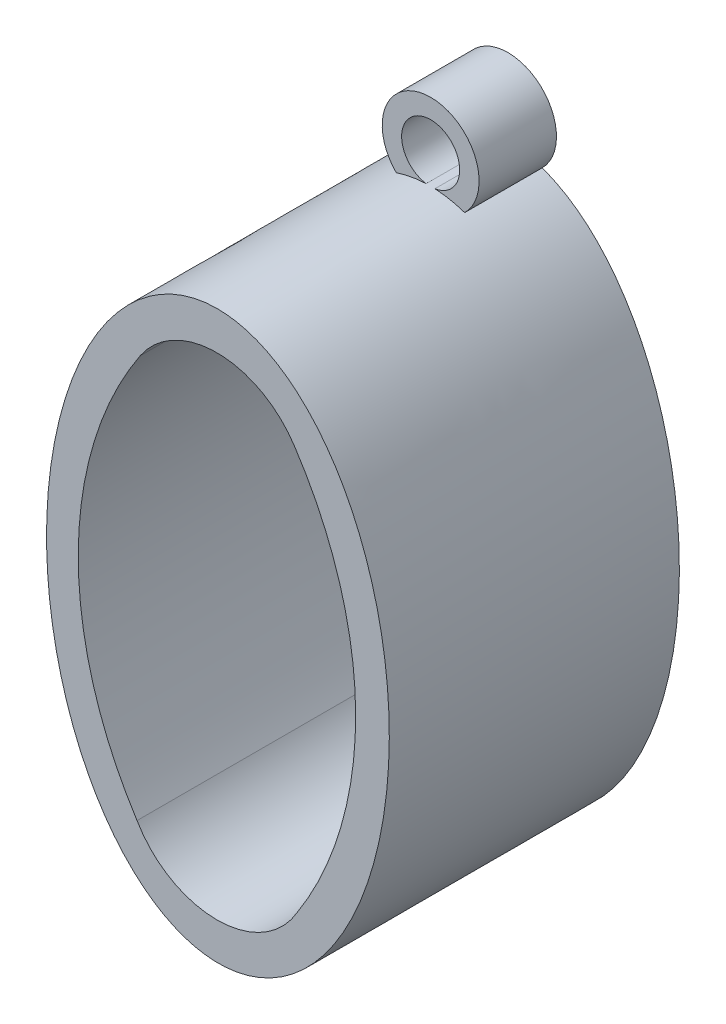
ISO-10303-21;
HEADER;
FILE_DESCRIPTION(('STEP AP214'),'2;1');
FILE_NAME('part.step','',(''),(''),'','','');
FILE_SCHEMA(('AUTOMOTIVE_DESIGN { 1 0 10303 214 1 1 1 1 }'));
ENDSEC;
DATA;
#1=APPLICATION_CONTEXT('core data for automotive mechanical design processes');
#2=APPLICATION_PROTOCOL_DEFINITION('international standard','automotive_design',2000,#1);
#3=PRODUCT_CONTEXT('',#1,'mechanical');
#4=PRODUCT('Part','Part','',(#3));
#5=PRODUCT_RELATED_PRODUCT_CATEGORY('part','',(#4));
#6=PRODUCT_DEFINITION_FORMATION('','',#4);
#7=PRODUCT_DEFINITION_CONTEXT('part definition',#1,'design');
#8=PRODUCT_DEFINITION('design','',#6,#7);
#9=PRODUCT_DEFINITION_SHAPE('','',#8);
#10=(LENGTH_UNIT() NAMED_UNIT(*) SI_UNIT(.MILLI.,.METRE.));
#11=(NAMED_UNIT(*) PLANE_ANGLE_UNIT() SI_UNIT($,.RADIAN.));
#12=(NAMED_UNIT(*) SI_UNIT($,.STERADIAN.) SOLID_ANGLE_UNIT());
#13=UNCERTAINTY_MEASURE_WITH_UNIT(LENGTH_MEASURE(1.E-05),#10,'distance_accuracy_value','');
#14=(GEOMETRIC_REPRESENTATION_CONTEXT(3) GLOBAL_UNCERTAINTY_ASSIGNED_CONTEXT((#13)) GLOBAL_UNIT_ASSIGNED_CONTEXT((#10,
#11,#12)) REPRESENTATION_CONTEXT('',''));
#15=CARTESIAN_POINT('',(0.,0.,0.));
#16=DIRECTION('',(0.,0.,1.));
#17=DIRECTION('',(1.,0.,0.));
#18=AXIS2_PLACEMENT_3D('',#15,#16,#17);
#19=CARTESIAN_POINT('',(0.,0.,15.));
#20=DIRECTION('',(0.,0.,1.));
#21=DIRECTION('',(1.,0.,0.));
#22=AXIS2_PLACEMENT_3D('',#19,#20,#21);
#23=PLANE('',#22);
#24=CARTESIAN_POINT('',(0.,0.,15.));
#25=DIRECTION('',(0.,0.,1.));
#26=DIRECTION('',(-0.00347416614958215,0.999993965066572,0.));
#27=AXIS2_PLACEMENT_3D('',#24,#25,#26);
#28=ELLIPSE('',#27,14.6452180036689,8.86218100127628);
#29=CARTESIAN_POINT('',(-0.0508799206415974,14.6451296207532,15.));
#30=VERTEX_POINT('',#29);
#31=EDGE_CURVE('E111',#30,#30,#28,.T.);
#32=ORIENTED_EDGE('',*,*,#31,.T.);
#33=EDGE_LOOP('',(#32));
#34=FACE_BOUND('',#33,.T.);
#35=CARTESIAN_POINT('',(-0.0499946264238908,-7.9621919744803,15.));
#36=DIRECTION('',(0.,0.,1.));
#37=DIRECTION('',(1.,0.,0.));
#38=AXIS2_PLACEMENT_3D('',#35,#36,#37);
#39=CIRCLE('',#38,4.7752);
#40=CARTESIAN_POINT('',(-4.18266193517475,-10.3545957771821,15.));
#41=VERTEX_POINT('',#40);
#42=CARTESIAN_POINT('',(4.08624409336584,-10.3484158308928,15.));
#43=VERTEX_POINT('',#42);
#44=EDGE_CURVE('E125',#41,#43,#39,.T.);
#45=ORIENTED_EDGE('',*,*,#44,.F.);
#46=CARTESIAN_POINT('',(11.8273820126439,-0.0307886892461032,15.));
#47=DIRECTION('',(0.,0.,1.));
#48=DIRECTION('',(1.,0.,0.));
#49=AXIS2_PLACEMENT_3D('',#46,#47,#48);
#50=CIRCLE('',#49,19.05);
#51=CARTESIAN_POINT('',(-4.02320958753552,10.5361998091068,15.));
#52=VERTEX_POINT('',#51);
#53=EDGE_CURVE('E123',#52,#41,#50,.T.);
#54=ORIENTED_EDGE('',*,*,#53,.F.);
#55=CARTESIAN_POINT('',(-0.0499946264238908,7.8874080255197,15.));
#56=DIRECTION('',(0.,0.,1.));
#57=DIRECTION('',(1.,0.,0.));
#58=AXIS2_PLACEMENT_3D('',#55,#56,#57);
#59=CIRCLE('',#58,4.7752);
#60=CARTESIAN_POINT('',(3.95954245501899,10.4808897456277,15.));
#61=VERTEX_POINT('',#60);
#62=EDGE_CURVE('E131',#61,#52,#59,.T.);
#63=ORIENTED_EDGE('',*,*,#62,.F.);
#64=CARTESIAN_POINT('',(-11.9277832004149,-0.0307886892461032,15.));
#65=DIRECTION('',(0.,0.,1.));
#66=DIRECTION('',(1.,0.,0.));
#67=AXIS2_PLACEMENT_3D('',#64,#65,#66);
#68=CIRCLE('',#67,19.05);
#69=EDGE_CURVE('E128',#43,#61,#68,.T.);
#70=ORIENTED_EDGE('',*,*,#69,.F.);
#71=EDGE_LOOP('',(#45,#54,#63,#70));
#72=FACE_BOUND('',#71,.T.);
#73=ADVANCED_FACE('F33',(#34,#72),#23,.T.);
#74=CARTESIAN_POINT('',(0.,0.,0.));
#75=DIRECTION('',(0.,0.,1.));
#76=DIRECTION('',(1.,0.,0.));
#77=AXIS2_PLACEMENT_3D('',#74,#75,#76);
#78=PLANE('',#77);
#79=CARTESIAN_POINT('',(0.,0.,0.));
#80=DIRECTION('',(0.,0.,1.));
#81=DIRECTION('',(-0.00347416614958215,0.999993965066572,0.));
#82=AXIS2_PLACEMENT_3D('',#79,#80,#81);
#83=ELLIPSE('',#82,14.6452180036689,8.86218100127628);
#84=CARTESIAN_POINT('',(-1.77711092169693,14.3582882787311,0.));
#85=VERTEX_POINT('',#84);
#86=CARTESIAN_POINT('',(1.76116803773183,14.3423786443097,0.));
#87=VERTEX_POINT('',#86);
#88=EDGE_CURVE('E156',#85,#87,#83,.T.);
#89=ORIENTED_EDGE('',*,*,#88,.F.);
#90=CARTESIAN_POINT('',(0.,16.1231702656899,0.));
#91=DIRECTION('',(0.,0.,-1.));
#92=DIRECTION('',(-1.,0.,0.));
#93=AXIS2_PLACEMENT_3D('',#90,#91,#92);
#94=CIRCLE('',#93,2.50458213199453);
#95=EDGE_CURVE('E114',#85,#87,#94,.T.);
#96=ORIENTED_EDGE('',*,*,#95,.T.);
#97=EDGE_LOOP('',(#89,#96));
#98=FACE_BOUND('',#97,.T.);
#99=CARTESIAN_POINT('',(11.8273820126439,-0.0307886892461032,0.));
#100=DIRECTION('',(0.,0.,1.));
#101=DIRECTION('',(1.,0.,0.));
#102=AXIS2_PLACEMENT_3D('',#99,#100,#101);
#103=CIRCLE('',#102,19.05);
#104=CARTESIAN_POINT('',(-4.02320958753552,10.5361998091068,0.));
#105=VERTEX_POINT('',#104);
#106=CARTESIAN_POINT('',(-4.18266193517475,-10.3545957771821,0.));
#107=VERTEX_POINT('',#106);
#108=EDGE_CURVE('E121',#105,#107,#103,.T.);
#109=ORIENTED_EDGE('',*,*,#108,.T.);
#110=CARTESIAN_POINT('',(-0.0499946264238908,-7.9621919744803,0.));
#111=DIRECTION('',(0.,0.,1.));
#112=DIRECTION('',(1.,0.,0.));
#113=AXIS2_PLACEMENT_3D('',#110,#111,#112);
#114=CIRCLE('',#113,4.7752);
#115=CARTESIAN_POINT('',(4.08624409336584,-10.3484158308928,0.));
#116=VERTEX_POINT('',#115);
#117=EDGE_CURVE('E136',#107,#116,#114,.T.);
#118=ORIENTED_EDGE('',*,*,#117,.T.);
#119=CARTESIAN_POINT('',(-11.9277832004149,-0.0307886892461032,0.));
#120=DIRECTION('',(0.,0.,1.));
#121=DIRECTION('',(1.,0.,0.));
#122=AXIS2_PLACEMENT_3D('',#119,#120,#121);
#123=CIRCLE('',#122,19.05);
#124=CARTESIAN_POINT('',(3.95954245501899,10.4808897456277,0.));
#125=VERTEX_POINT('',#124);
#126=EDGE_CURVE('E139',#116,#125,#123,.T.);
#127=ORIENTED_EDGE('',*,*,#126,.T.);
#128=CARTESIAN_POINT('',(-0.0499946264238908,7.8874080255197,0.));
#129=DIRECTION('',(0.,0.,1.));
#130=DIRECTION('',(1.,0.,0.));
#131=AXIS2_PLACEMENT_3D('',#128,#129,#130);
#132=CIRCLE('',#131,4.7752);
#133=EDGE_CURVE('E126',#125,#105,#132,.T.);
#134=ORIENTED_EDGE('',*,*,#133,.T.);
#135=EDGE_LOOP('',(#109,#118,#127,#134));
#136=FACE_BOUND('',#135,.T.);
#137=CARTESIAN_POINT('',(0.219166915189247,14.6392680238672,0.));
#138=VERTEX_POINT('',#137);
#139=CARTESIAN_POINT('',(-0.233136717895372,14.6413985994846,0.));
#140=VERTEX_POINT('',#139);
#141=EDGE_CURVE('E152',#138,#140,#83,.T.);
#142=ORIENTED_EDGE('',*,*,#141,.F.);
#143=CARTESIAN_POINT('',(0.,16.1231702656899,0.));
#144=DIRECTION('',(0.,0.,-1.));
#145=DIRECTION('',(-1.,0.,0.));
#146=AXIS2_PLACEMENT_3D('',#143,#144,#145);
#147=CIRCLE('',#146,1.5);
#148=EDGE_CURVE('E110',#140,#138,#147,.T.);
#149=ORIENTED_EDGE('',*,*,#148,.F.);
#150=EDGE_LOOP('',(#142,#149));
#151=FACE_BOUND('',#150,.T.);
#152=ADVANCED_FACE('F159',(#98,#136,#151),#78,.F.);
#153=DIRECTION('',(0.,0.,-1.));
#154=VECTOR('',#153,1.);
#155=SURFACE_OF_LINEAR_EXTRUSION('',#28,#154);
#156=ORIENTED_EDGE('',*,*,#31,.F.);
#157=EDGE_LOOP('',(#156));
#158=FACE_BOUND('',#157,.T.);
#159=CARTESIAN_POINT('',(0.,0.,4.));
#160=DIRECTION('',(0.,0.,1.));
#161=DIRECTION('',(-0.00347416614958215,0.999993965066572,0.));
#162=AXIS2_PLACEMENT_3D('',#159,#160,#161);
#163=ELLIPSE('',#162,14.6452180036689,8.86218100127628);
#164=CARTESIAN_POINT('',(-1.77711092169692,14.3582882787311,4.));
#165=VERTEX_POINT('',#164);
#166=CARTESIAN_POINT('',(-0.233136717895372,14.6413985994846,4.));
#167=VERTEX_POINT('',#166);
#168=EDGE_CURVE('E42',#165,#167,#163,.F.);
#169=ORIENTED_EDGE('',*,*,#168,.F.);
#170=DIRECTION('',(0.,0.,-1.));
#171=VECTOR('',#170,1.);
#172=CARTESIAN_POINT('',(-1.77711092169693,14.3582882787311,15.));
#173=LINE('',#172,#171);
#174=EDGE_CURVE('E11',#165,#85,#173,.T.);
#175=ORIENTED_EDGE('',*,*,#174,.T.);
#176=ORIENTED_EDGE('',*,*,#88,.T.);
#177=DIRECTION('',(0.,0.,-1.));
#178=VECTOR('',#177,1.);
#179=CARTESIAN_POINT('',(1.76116803773183,14.3423786443097,15.));
#180=LINE('',#179,#178);
#181=CARTESIAN_POINT('',(1.76116803773182,14.3423786443097,4.));
#182=VERTEX_POINT('',#181);
#183=EDGE_CURVE('E98',#87,#182,#180,.F.);
#184=ORIENTED_EDGE('',*,*,#183,.T.);
#185=CARTESIAN_POINT('',(0.219166915189248,14.6392680238672,4.));
#186=VERTEX_POINT('',#185);
#187=EDGE_CURVE('E93',#186,#182,#163,.F.);
#188=ORIENTED_EDGE('',*,*,#187,.F.);
#189=DIRECTION('',(0.,0.,-1.));
#190=VECTOR('',#189,1.);
#191=CARTESIAN_POINT('',(0.219166915189247,14.6392680238672,15.));
#192=LINE('',#191,#190);
#193=EDGE_CURVE('E95',#138,#186,#192,.F.);
#194=ORIENTED_EDGE('',*,*,#193,.F.);
#195=ORIENTED_EDGE('',*,*,#141,.T.);
#196=DIRECTION('',(0.,0.,-1.));
#197=VECTOR('',#196,1.);
#198=CARTESIAN_POINT('',(-0.233136717895372,14.6413985994846,15.));
#199=LINE('',#198,#197);
#200=EDGE_CURVE('E52',#167,#140,#199,.T.);
#201=ORIENTED_EDGE('',*,*,#200,.F.);
#202=EDGE_LOOP('',(#169,#175,#176,#184,#188,#194,#195,#201));
#203=FACE_BOUND('',#202,.T.);
#204=ADVANCED_FACE('F35',(#158,#203),#155,.F.);
#205=CARTESIAN_POINT('',(11.8273820126439,-0.0307886892461032,15.));
#206=DIRECTION('',(0.,0.,-1.));
#207=DIRECTION('',(-1.,0.,0.));
#208=AXIS2_PLACEMENT_3D('',#205,#206,#207);
#209=CYLINDRICAL_SURFACE('',#208,19.05);
#210=ORIENTED_EDGE('',*,*,#108,.F.);
#211=DIRECTION('',(0.,0.,-1.));
#212=VECTOR('',#211,1.);
#213=CARTESIAN_POINT('',(-4.02320958753552,10.5361998091068,15.));
#214=LINE('',#213,#212);
#215=EDGE_CURVE('E133',#52,#105,#214,.T.);
#216=ORIENTED_EDGE('',*,*,#215,.F.);
#217=ORIENTED_EDGE('',*,*,#53,.T.);
#218=DIRECTION('',(0.,0.,-1.));
#219=VECTOR('',#218,1.);
#220=CARTESIAN_POINT('',(-4.18266193517475,-10.3545957771821,15.));
#221=LINE('',#220,#219);
#222=EDGE_CURVE('E150',#41,#107,#221,.T.);
#223=ORIENTED_EDGE('',*,*,#222,.T.);
#224=EDGE_LOOP('',(#210,#216,#217,#223));
#225=FACE_BOUND('',#224,.T.);
#226=ADVANCED_FACE('F166',(#225),#209,.F.);
#227=CARTESIAN_POINT('',(-0.0499946264238908,-7.9621919744803,15.));
#228=DIRECTION('',(0.,0.,-1.));
#229=DIRECTION('',(-1.,0.,0.));
#230=AXIS2_PLACEMENT_3D('',#227,#228,#229);
#231=CYLINDRICAL_SURFACE('',#230,4.7752);
#232=ORIENTED_EDGE('',*,*,#117,.F.);
#233=ORIENTED_EDGE('',*,*,#222,.F.);
#234=ORIENTED_EDGE('',*,*,#44,.T.);
#235=DIRECTION('',(0.,0.,-1.));
#236=VECTOR('',#235,1.);
#237=CARTESIAN_POINT('',(4.08624409336584,-10.3484158308928,15.));
#238=LINE('',#237,#236);
#239=EDGE_CURVE('E148',#43,#116,#238,.T.);
#240=ORIENTED_EDGE('',*,*,#239,.T.);
#241=EDGE_LOOP('',(#232,#233,#234,#240));
#242=FACE_BOUND('',#241,.T.);
#243=ADVANCED_FACE('F175',(#242),#231,.F.);
#244=CARTESIAN_POINT('',(-11.9277832004149,-0.0307886892461032,15.));
#245=DIRECTION('',(0.,0.,-1.));
#246=DIRECTION('',(-1.,0.,0.));
#247=AXIS2_PLACEMENT_3D('',#244,#245,#246);
#248=CYLINDRICAL_SURFACE('',#247,19.05);
#249=ORIENTED_EDGE('',*,*,#126,.F.);
#250=ORIENTED_EDGE('',*,*,#239,.F.);
#251=ORIENTED_EDGE('',*,*,#69,.T.);
#252=DIRECTION('',(0.,0.,-1.));
#253=VECTOR('',#252,1.);
#254=CARTESIAN_POINT('',(3.95954245501899,10.4808897456277,15.));
#255=LINE('',#254,#253);
#256=EDGE_CURVE('E146',#61,#125,#255,.T.);
#257=ORIENTED_EDGE('',*,*,#256,.T.);
#258=EDGE_LOOP('',(#249,#250,#251,#257));
#259=FACE_BOUND('',#258,.T.);
#260=ADVANCED_FACE('F179',(#259),#248,.F.);
#261=CARTESIAN_POINT('',(-0.0499946264238908,7.8874080255197,15.));
#262=DIRECTION('',(0.,0.,-1.));
#263=DIRECTION('',(-1.,0.,0.));
#264=AXIS2_PLACEMENT_3D('',#261,#262,#263);
#265=CYLINDRICAL_SURFACE('',#264,4.7752);
#266=ORIENTED_EDGE('',*,*,#133,.F.);
#267=ORIENTED_EDGE('',*,*,#256,.F.);
#268=ORIENTED_EDGE('',*,*,#62,.T.);
#269=ORIENTED_EDGE('',*,*,#215,.T.);
#270=EDGE_LOOP('',(#266,#267,#268,#269));
#271=FACE_BOUND('',#270,.T.);
#272=ADVANCED_FACE('F183',(#271),#265,.F.);
#273=CARTESIAN_POINT('',(0.,16.1231702656899,4.));
#274=DIRECTION('',(0.,0.,-1.));
#275=DIRECTION('',(-1.,0.,0.));
#276=AXIS2_PLACEMENT_3D('',#273,#274,#275);
#277=CYLINDRICAL_SURFACE('',#276,2.50458213199453);
#278=ORIENTED_EDGE('',*,*,#174,.F.);
#279=CARTESIAN_POINT('',(0.,16.1231702656899,4.));
#280=DIRECTION('',(0.,0.,-1.));
#281=DIRECTION('',(-1.,0.,0.));
#282=AXIS2_PLACEMENT_3D('',#279,#280,#281);
#283=CIRCLE('',#282,2.50458213199453);
#284=EDGE_CURVE('E117',#165,#182,#283,.T.);
#285=ORIENTED_EDGE('',*,*,#284,.T.);
#286=ORIENTED_EDGE('',*,*,#183,.F.);
#287=ORIENTED_EDGE('',*,*,#95,.F.);
#288=EDGE_LOOP('',(#278,#285,#286,#287));
#289=FACE_BOUND('',#288,.T.);
#290=ADVANCED_FACE('F187',(#289),#277,.T.);
#291=CARTESIAN_POINT('',(0.,16.1231702656899,4.));
#292=DIRECTION('',(0.,0.,-1.));
#293=DIRECTION('',(-1.,0.,0.));
#294=AXIS2_PLACEMENT_3D('',#291,#292,#293);
#295=PLANE('',#294);
#296=CARTESIAN_POINT('',(0.,16.1231702656899,4.));
#297=DIRECTION('',(0.,0.,-1.));
#298=DIRECTION('',(-1.,0.,0.));
#299=AXIS2_PLACEMENT_3D('',#296,#297,#298);
#300=CIRCLE('',#299,1.5);
#301=EDGE_CURVE('E108',#167,#186,#300,.T.);
#302=ORIENTED_EDGE('',*,*,#301,.T.);
#303=ORIENTED_EDGE('',*,*,#187,.T.);
#304=ORIENTED_EDGE('',*,*,#284,.F.);
#305=ORIENTED_EDGE('',*,*,#168,.T.);
#306=EDGE_LOOP('',(#302,#303,#304,#305));
#307=FACE_BOUND('',#306,.T.);
#308=ADVANCED_FACE('F113',(#307),#295,.F.);
#309=CARTESIAN_POINT('',(0.,16.1231702656899,4.));
#310=DIRECTION('',(0.,0.,-1.));
#311=DIRECTION('',(-1.,0.,0.));
#312=AXIS2_PLACEMENT_3D('',#309,#310,#311);
#313=CYLINDRICAL_SURFACE('',#312,1.5);
#314=ORIENTED_EDGE('',*,*,#301,.F.);
#315=ORIENTED_EDGE('',*,*,#200,.T.);
#316=ORIENTED_EDGE('',*,*,#148,.T.);
#317=ORIENTED_EDGE('',*,*,#193,.T.);
#318=EDGE_LOOP('',(#314,#315,#316,#317));
#319=FACE_BOUND('',#318,.T.);
#320=ADVANCED_FACE('F107',(#319),#313,.F.);
#321=CLOSED_SHELL('',(#73,#152,#204,#226,#243,#260,#272,#290,#308,#320));
#322=MANIFOLD_SOLID_BREP('B2',#321);
#323=ADVANCED_BREP_SHAPE_REPRESENTATION('',(#18,#322),#14);
#324=SHAPE_DEFINITION_REPRESENTATION(#9,#323);
ENDSEC;
END-ISO-10303-21;
